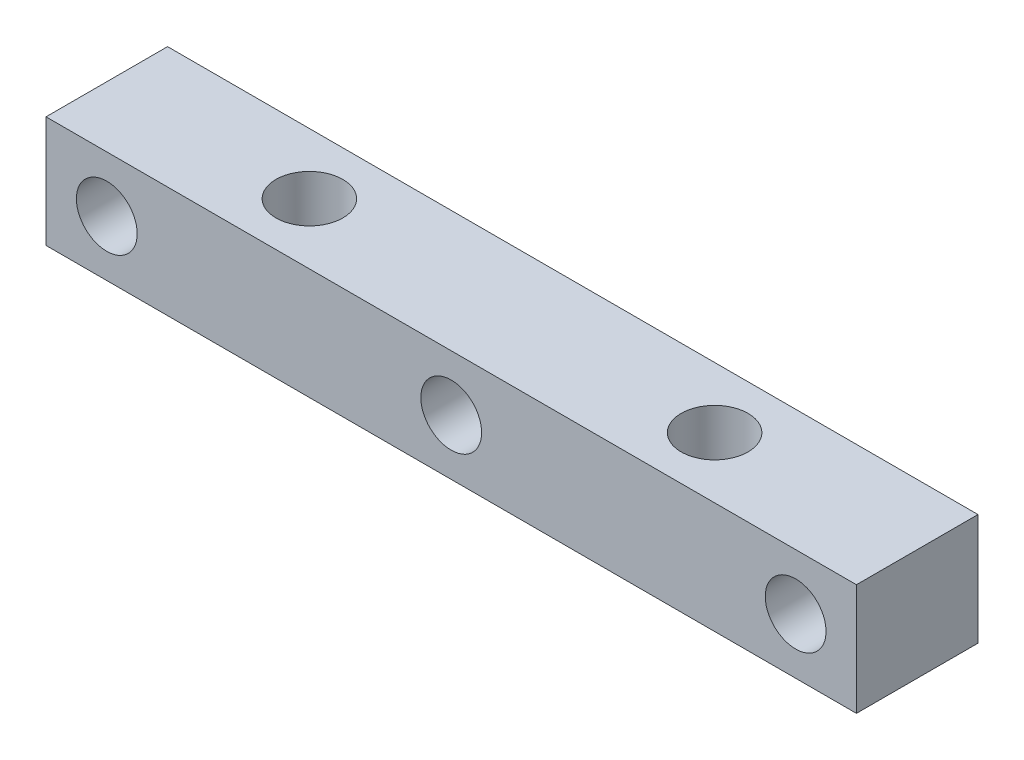
ISO-10303-21;
HEADER;
FILE_DESCRIPTION(('STEP AP214'),'2;1');
FILE_NAME('part.step','',(''),(''),'','','');
FILE_SCHEMA(('AUTOMOTIVE_DESIGN { 1 0 10303 214 1 1 1 1 }'));
ENDSEC;
DATA;
#1=APPLICATION_CONTEXT('core data for automotive mechanical design processes');
#2=APPLICATION_PROTOCOL_DEFINITION('international standard','automotive_design',2000,#1);
#3=PRODUCT_CONTEXT('',#1,'mechanical');
#4=PRODUCT('Part','Part','',(#3));
#5=PRODUCT_RELATED_PRODUCT_CATEGORY('part','',(#4));
#6=PRODUCT_DEFINITION_FORMATION('','',#4);
#7=PRODUCT_DEFINITION_CONTEXT('part definition',#1,'design');
#8=PRODUCT_DEFINITION('design','',#6,#7);
#9=PRODUCT_DEFINITION_SHAPE('','',#8);
#10=(LENGTH_UNIT() NAMED_UNIT(*) SI_UNIT(.MILLI.,.METRE.));
#11=(NAMED_UNIT(*) PLANE_ANGLE_UNIT() SI_UNIT($,.RADIAN.));
#12=(NAMED_UNIT(*) SI_UNIT($,.STERADIAN.) SOLID_ANGLE_UNIT());
#13=UNCERTAINTY_MEASURE_WITH_UNIT(LENGTH_MEASURE(1.E-05),#10,'distance_accuracy_value','');
#14=(GEOMETRIC_REPRESENTATION_CONTEXT(3) GLOBAL_UNCERTAINTY_ASSIGNED_CONTEXT((#13)) GLOBAL_UNIT_ASSIGNED_CONTEXT((#10,
#11,#12)) REPRESENTATION_CONTEXT('',''));
#15=CARTESIAN_POINT('',(0.,0.,0.));
#16=DIRECTION('',(0.,0.,1.));
#17=DIRECTION('',(1.,0.,0.));
#18=AXIS2_PLACEMENT_3D('',#15,#16,#17);
#19=CARTESIAN_POINT('',(0.,0.,6.));
#20=DIRECTION('',(1.,0.,0.));
#21=DIRECTION('',(0.,0.,-1.));
#22=AXIS2_PLACEMENT_3D('',#19,#20,#21);
#23=PLANE('',#22);
#24=DIRECTION('',(0.,-1.,0.));
#25=VECTOR('',#24,1.);
#26=CARTESIAN_POINT('',(0.,0.,0.));
#27=LINE('',#26,#25);
#28=CARTESIAN_POINT('',(0.,5.5,0.));
#29=VERTEX_POINT('',#28);
#30=CARTESIAN_POINT('',(0.,0.,0.));
#31=VERTEX_POINT('',#30);
#32=EDGE_CURVE('E98',#29,#31,#27,.T.);
#33=ORIENTED_EDGE('',*,*,#32,.T.);
#34=DIRECTION('',(0.,0.,-1.));
#35=VECTOR('',#34,1.);
#36=CARTESIAN_POINT('',(0.,0.,6.));
#37=LINE('',#36,#35);
#38=CARTESIAN_POINT('',(0.,0.,6.));
#39=VERTEX_POINT('',#38);
#40=EDGE_CURVE('E11',#39,#31,#37,.T.);
#41=ORIENTED_EDGE('',*,*,#40,.F.);
#42=DIRECTION('',(0.,-1.,0.));
#43=VECTOR('',#42,1.);
#44=CARTESIAN_POINT('',(0.,0.,6.));
#45=LINE('',#44,#43);
#46=CARTESIAN_POINT('',(0.,5.5,6.));
#47=VERTEX_POINT('',#46);
#48=EDGE_CURVE('E85',#47,#39,#45,.T.);
#49=ORIENTED_EDGE('',*,*,#48,.F.);
#50=DIRECTION('',(0.,0.,-1.));
#51=VECTOR('',#50,1.);
#52=CARTESIAN_POINT('',(0.,5.5,6.));
#53=LINE('',#52,#51);
#54=EDGE_CURVE('E94',#47,#29,#53,.T.);
#55=ORIENTED_EDGE('',*,*,#54,.T.);
#56=EDGE_LOOP('',(#33,#41,#49,#55));
#57=FACE_BOUND('',#56,.T.);
#58=ADVANCED_FACE('F32',(#57),#23,.F.);
#59=CARTESIAN_POINT('',(0.,0.,6.));
#60=DIRECTION('',(0.,1.,0.));
#61=DIRECTION('',(0.,0.,1.));
#62=AXIS2_PLACEMENT_3D('',#59,#60,#61);
#63=PLANE('',#62);
#64=CARTESIAN_POINT('',(30.,0.,3.));
#65=DIRECTION('',(0.,1.,0.));
#66=DIRECTION('',(0.,0.,-1.));
#67=AXIS2_PLACEMENT_3D('',#64,#65,#66);
#68=CIRCLE('',#67,1.65);
#69=CARTESIAN_POINT('',(30.,0.,1.35));
#70=VERTEX_POINT('',#69);
#71=EDGE_CURVE('E120',#70,#70,#68,.T.);
#72=ORIENTED_EDGE('',*,*,#71,.T.);
#73=EDGE_LOOP('',(#72));
#74=FACE_BOUND('',#73,.T.);
#75=CARTESIAN_POINT('',(10.,0.,3.));
#76=DIRECTION('',(0.,1.,0.));
#77=DIRECTION('',(0.,0.,1.));
#78=AXIS2_PLACEMENT_3D('',#75,#76,#77);
#79=CIRCLE('',#78,1.65);
#80=CARTESIAN_POINT('',(10.,0.,4.65));
#81=VERTEX_POINT('',#80);
#82=EDGE_CURVE('E109',#81,#81,#79,.T.);
#83=ORIENTED_EDGE('',*,*,#82,.T.);
#84=EDGE_LOOP('',(#83));
#85=FACE_BOUND('',#84,.T.);
#86=DIRECTION('',(1.,0.,0.));
#87=VECTOR('',#86,1.);
#88=CARTESIAN_POINT('',(0.,0.,0.));
#89=LINE('',#88,#87);
#90=CARTESIAN_POINT('',(40.,0.,0.));
#91=VERTEX_POINT('',#90);
#92=EDGE_CURVE('E89',#31,#91,#89,.T.);
#93=ORIENTED_EDGE('',*,*,#92,.T.);
#94=DIRECTION('',(0.,0.,-1.));
#95=VECTOR('',#94,1.);
#96=CARTESIAN_POINT('',(40.,0.,6.));
#97=LINE('',#96,#95);
#98=CARTESIAN_POINT('',(40.,0.,6.));
#99=VERTEX_POINT('',#98);
#100=EDGE_CURVE('E41',#99,#91,#97,.T.);
#101=ORIENTED_EDGE('',*,*,#100,.F.);
#102=DIRECTION('',(1.,0.,0.));
#103=VECTOR('',#102,1.);
#104=CARTESIAN_POINT('',(0.,0.,6.));
#105=LINE('',#104,#103);
#106=EDGE_CURVE('E80',#39,#99,#105,.T.);
#107=ORIENTED_EDGE('',*,*,#106,.F.);
#108=ORIENTED_EDGE('',*,*,#40,.T.);
#109=EDGE_LOOP('',(#93,#101,#107,#108));
#110=FACE_BOUND('',#109,.T.);
#111=ADVANCED_FACE('F88',(#74,#85,#110),#63,.F.);
#112=CARTESIAN_POINT('',(40.,0.,6.));
#113=DIRECTION('',(-1.,0.,0.));
#114=DIRECTION('',(0.,0.,1.));
#115=AXIS2_PLACEMENT_3D('',#112,#113,#114);
#116=PLANE('',#115);
#117=DIRECTION('',(0.,1.,0.));
#118=VECTOR('',#117,1.);
#119=CARTESIAN_POINT('',(40.,0.,0.));
#120=LINE('',#119,#118);
#121=CARTESIAN_POINT('',(40.,5.5,0.));
#122=VERTEX_POINT('',#121);
#123=EDGE_CURVE('E67',#91,#122,#120,.T.);
#124=ORIENTED_EDGE('',*,*,#123,.T.);
#125=DIRECTION('',(0.,0.,-1.));
#126=VECTOR('',#125,1.);
#127=CARTESIAN_POINT('',(40.,5.5,6.));
#128=LINE('',#127,#126);
#129=CARTESIAN_POINT('',(40.,5.5,6.));
#130=VERTEX_POINT('',#129);
#131=EDGE_CURVE('E90',#130,#122,#128,.T.);
#132=ORIENTED_EDGE('',*,*,#131,.F.);
#133=DIRECTION('',(0.,1.,0.));
#134=VECTOR('',#133,1.);
#135=CARTESIAN_POINT('',(40.,0.,6.));
#136=LINE('',#135,#134);
#137=EDGE_CURVE('E83',#99,#130,#136,.T.);
#138=ORIENTED_EDGE('',*,*,#137,.F.);
#139=ORIENTED_EDGE('',*,*,#100,.T.);
#140=EDGE_LOOP('',(#124,#132,#138,#139));
#141=FACE_BOUND('',#140,.T.);
#142=ADVANCED_FACE('F92',(#141),#116,.F.);
#143=CARTESIAN_POINT('',(0.,5.5,6.));
#144=DIRECTION('',(0.,-1.,0.));
#145=DIRECTION('',(0.,0.,-1.));
#146=AXIS2_PLACEMENT_3D('',#143,#144,#145);
#147=PLANE('',#146);
#148=CARTESIAN_POINT('',(30.,5.5,3.));
#149=DIRECTION('',(0.,-1.,0.));
#150=DIRECTION('',(0.,0.,-1.));
#151=AXIS2_PLACEMENT_3D('',#148,#149,#150);
#152=CIRCLE('',#151,1.65);
#153=CARTESIAN_POINT('',(30.,5.5,1.35));
#154=VERTEX_POINT('',#153);
#155=EDGE_CURVE('E35',#154,#154,#152,.T.);
#156=ORIENTED_EDGE('',*,*,#155,.T.);
#157=EDGE_LOOP('',(#156));
#158=FACE_BOUND('',#157,.T.);
#159=CARTESIAN_POINT('',(10.,5.5,3.));
#160=DIRECTION('',(0.,-1.,0.));
#161=DIRECTION('',(0.,0.,-1.));
#162=AXIS2_PLACEMENT_3D('',#159,#160,#161);
#163=CIRCLE('',#162,1.65);
#164=CARTESIAN_POINT('',(10.,5.5,1.35));
#165=VERTEX_POINT('',#164);
#166=EDGE_CURVE('E106',#165,#165,#163,.T.);
#167=ORIENTED_EDGE('',*,*,#166,.T.);
#168=EDGE_LOOP('',(#167));
#169=FACE_BOUND('',#168,.T.);
#170=DIRECTION('',(-1.,0.,0.));
#171=VECTOR('',#170,1.);
#172=CARTESIAN_POINT('',(0.,5.5,0.));
#173=LINE('',#172,#171);
#174=EDGE_CURVE('E73',#122,#29,#173,.T.);
#175=ORIENTED_EDGE('',*,*,#174,.T.);
#176=ORIENTED_EDGE('',*,*,#54,.F.);
#177=DIRECTION('',(-1.,0.,0.));
#178=VECTOR('',#177,1.);
#179=CARTESIAN_POINT('',(0.,5.5,6.));
#180=LINE('',#179,#178);
#181=EDGE_CURVE('E50',#130,#47,#180,.T.);
#182=ORIENTED_EDGE('',*,*,#181,.F.);
#183=ORIENTED_EDGE('',*,*,#131,.T.);
#184=EDGE_LOOP('',(#175,#176,#182,#183));
#185=FACE_BOUND('',#184,.T.);
#186=ADVANCED_FACE('F163',(#158,#169,#185),#147,.F.);
#187=CARTESIAN_POINT('',(0.,0.,6.));
#188=DIRECTION('',(0.,0.,-1.));
#189=DIRECTION('',(-1.,0.,0.));
#190=AXIS2_PLACEMENT_3D('',#187,#188,#189);
#191=PLANE('',#190);
#192=CARTESIAN_POINT('',(3.,2.75,6.));
#193=DIRECTION('',(0.,0.,-1.));
#194=DIRECTION('',(-1.,0.,0.));
#195=AXIS2_PLACEMENT_3D('',#192,#193,#194);
#196=CIRCLE('',#195,1.5);
#197=CARTESIAN_POINT('',(1.5,2.75,6.));
#198=VERTEX_POINT('',#197);
#199=EDGE_CURVE('E128',#198,#198,#196,.T.);
#200=ORIENTED_EDGE('',*,*,#199,.T.);
#201=EDGE_LOOP('',(#200));
#202=FACE_BOUND('',#201,.T.);
#203=CARTESIAN_POINT('',(37.,2.75,6.));
#204=DIRECTION('',(0.,0.,-1.));
#205=DIRECTION('',(-1.,0.,0.));
#206=AXIS2_PLACEMENT_3D('',#203,#204,#205);
#207=CIRCLE('',#206,1.5);
#208=CARTESIAN_POINT('',(35.5,2.75,6.));
#209=VERTEX_POINT('',#208);
#210=EDGE_CURVE('E124',#209,#209,#207,.T.);
#211=ORIENTED_EDGE('',*,*,#210,.T.);
#212=EDGE_LOOP('',(#211));
#213=FACE_BOUND('',#212,.T.);
#214=CARTESIAN_POINT('',(20.,2.75,6.));
#215=DIRECTION('',(0.,0.,-1.));
#216=DIRECTION('',(-1.,0.,0.));
#217=AXIS2_PLACEMENT_3D('',#214,#215,#216);
#218=CIRCLE('',#217,1.5);
#219=CARTESIAN_POINT('',(18.5,2.75,6.));
#220=VERTEX_POINT('',#219);
#221=EDGE_CURVE('E101',#220,#220,#218,.T.);
#222=ORIENTED_EDGE('',*,*,#221,.T.);
#223=EDGE_LOOP('',(#222));
#224=FACE_BOUND('',#223,.T.);
#225=ORIENTED_EDGE('',*,*,#48,.T.);
#226=ORIENTED_EDGE('',*,*,#106,.T.);
#227=ORIENTED_EDGE('',*,*,#137,.T.);
#228=ORIENTED_EDGE('',*,*,#181,.T.);
#229=EDGE_LOOP('',(#225,#226,#227,#228));
#230=FACE_BOUND('',#229,.T.);
#231=ADVANCED_FACE('F81',(#202,#213,#224,#230),#191,.F.);
#232=CARTESIAN_POINT('',(0.,0.,0.));
#233=DIRECTION('',(0.,0.,-1.));
#234=DIRECTION('',(-1.,0.,0.));
#235=AXIS2_PLACEMENT_3D('',#232,#233,#234);
#236=PLANE('',#235);
#237=CARTESIAN_POINT('',(3.,2.75,0.));
#238=DIRECTION('',(0.,0.,1.));
#239=DIRECTION('',(1.,0.,0.));
#240=AXIS2_PLACEMENT_3D('',#237,#238,#239);
#241=CIRCLE('',#240,1.5);
#242=CARTESIAN_POINT('',(4.5,2.75,0.));
#243=VERTEX_POINT('',#242);
#244=EDGE_CURVE('E113',#243,#243,#241,.T.);
#245=ORIENTED_EDGE('',*,*,#244,.T.);
#246=EDGE_LOOP('',(#245));
#247=FACE_BOUND('',#246,.T.);
#248=CARTESIAN_POINT('',(37.,2.75,0.));
#249=DIRECTION('',(0.,0.,1.));
#250=DIRECTION('',(-1.,0.,0.));
#251=AXIS2_PLACEMENT_3D('',#248,#249,#250);
#252=CIRCLE('',#251,1.5);
#253=CARTESIAN_POINT('',(35.5,2.75,0.));
#254=VERTEX_POINT('',#253);
#255=EDGE_CURVE('E108',#254,#254,#252,.T.);
#256=ORIENTED_EDGE('',*,*,#255,.T.);
#257=EDGE_LOOP('',(#256));
#258=FACE_BOUND('',#257,.T.);
#259=CARTESIAN_POINT('',(20.,2.75,0.));
#260=DIRECTION('',(0.,0.,1.));
#261=DIRECTION('',(1.,0.,0.));
#262=AXIS2_PLACEMENT_3D('',#259,#260,#261);
#263=CIRCLE('',#262,1.5);
#264=CARTESIAN_POINT('',(21.5,2.75,0.));
#265=VERTEX_POINT('',#264);
#266=EDGE_CURVE('E131',#265,#265,#263,.T.);
#267=ORIENTED_EDGE('',*,*,#266,.T.);
#268=EDGE_LOOP('',(#267));
#269=FACE_BOUND('',#268,.T.);
#270=ORIENTED_EDGE('',*,*,#32,.F.);
#271=ORIENTED_EDGE('',*,*,#174,.F.);
#272=ORIENTED_EDGE('',*,*,#123,.F.);
#273=ORIENTED_EDGE('',*,*,#92,.F.);
#274=EDGE_LOOP('',(#270,#271,#272,#273));
#275=FACE_BOUND('',#274,.T.);
#276=ADVANCED_FACE('F141',(#247,#258,#269,#275),#236,.T.);
#277=CARTESIAN_POINT('',(20.,2.75,0.));
#278=DIRECTION('',(0.,0.,1.));
#279=DIRECTION('',(1.,0.,0.));
#280=AXIS2_PLACEMENT_3D('',#277,#278,#279);
#281=CYLINDRICAL_SURFACE('',#280,1.5);
#282=ORIENTED_EDGE('',*,*,#266,.F.);
#283=EDGE_LOOP('',(#282));
#284=FACE_BOUND('',#283,.T.);
#285=ORIENTED_EDGE('',*,*,#221,.F.);
#286=EDGE_LOOP('',(#285));
#287=FACE_BOUND('',#286,.T.);
#288=ADVANCED_FACE('F138',(#284,#287),#281,.F.);
#289=CARTESIAN_POINT('',(37.,2.75,0.));
#290=DIRECTION('',(0.,0.,1.));
#291=DIRECTION('',(1.,0.,0.));
#292=AXIS2_PLACEMENT_3D('',#289,#290,#291);
#293=CYLINDRICAL_SURFACE('',#292,1.5);
#294=ORIENTED_EDGE('',*,*,#255,.F.);
#295=EDGE_LOOP('',(#294));
#296=FACE_BOUND('',#295,.T.);
#297=ORIENTED_EDGE('',*,*,#210,.F.);
#298=EDGE_LOOP('',(#297));
#299=FACE_BOUND('',#298,.T.);
#300=ADVANCED_FACE('F140',(#296,#299),#293,.F.);
#301=CARTESIAN_POINT('',(3.,2.75,0.));
#302=DIRECTION('',(0.,0.,1.));
#303=DIRECTION('',(1.,0.,0.));
#304=AXIS2_PLACEMENT_3D('',#301,#302,#303);
#305=CYLINDRICAL_SURFACE('',#304,1.5);
#306=ORIENTED_EDGE('',*,*,#244,.F.);
#307=EDGE_LOOP('',(#306));
#308=FACE_BOUND('',#307,.T.);
#309=ORIENTED_EDGE('',*,*,#199,.F.);
#310=EDGE_LOOP('',(#309));
#311=FACE_BOUND('',#310,.T.);
#312=ADVANCED_FACE('F148',(#308,#311),#305,.F.);
#313=CARTESIAN_POINT('',(10.,0.,3.));
#314=DIRECTION('',(0.,1.,0.));
#315=DIRECTION('',(0.,0.,1.));
#316=AXIS2_PLACEMENT_3D('',#313,#314,#315);
#317=CYLINDRICAL_SURFACE('',#316,1.65);
#318=ORIENTED_EDGE('',*,*,#82,.F.);
#319=EDGE_LOOP('',(#318));
#320=FACE_BOUND('',#319,.T.);
#321=ORIENTED_EDGE('',*,*,#166,.F.);
#322=EDGE_LOOP('',(#321));
#323=FACE_BOUND('',#322,.T.);
#324=ADVANCED_FACE('F177',(#320,#323),#317,.F.);
#325=CARTESIAN_POINT('',(30.,0.,3.));
#326=DIRECTION('',(0.,1.,0.));
#327=DIRECTION('',(0.,0.,1.));
#328=AXIS2_PLACEMENT_3D('',#325,#326,#327);
#329=CYLINDRICAL_SURFACE('',#328,1.65);
#330=ORIENTED_EDGE('',*,*,#71,.F.);
#331=EDGE_LOOP('',(#330));
#332=FACE_BOUND('',#331,.T.);
#333=ORIENTED_EDGE('',*,*,#155,.F.);
#334=EDGE_LOOP('',(#333));
#335=FACE_BOUND('',#334,.T.);
#336=ADVANCED_FACE('F175',(#332,#335),#329,.F.);
#337=CLOSED_SHELL('',(#58,#111,#142,#186,#231,#276,#288,#300,#312,#324,#336));
#338=MANIFOLD_SOLID_BREP('B2',#337);
#339=ADVANCED_BREP_SHAPE_REPRESENTATION('',(#18,#338),#14);
#340=SHAPE_DEFINITION_REPRESENTATION(#9,#339);
ENDSEC;
END-ISO-10303-21;
